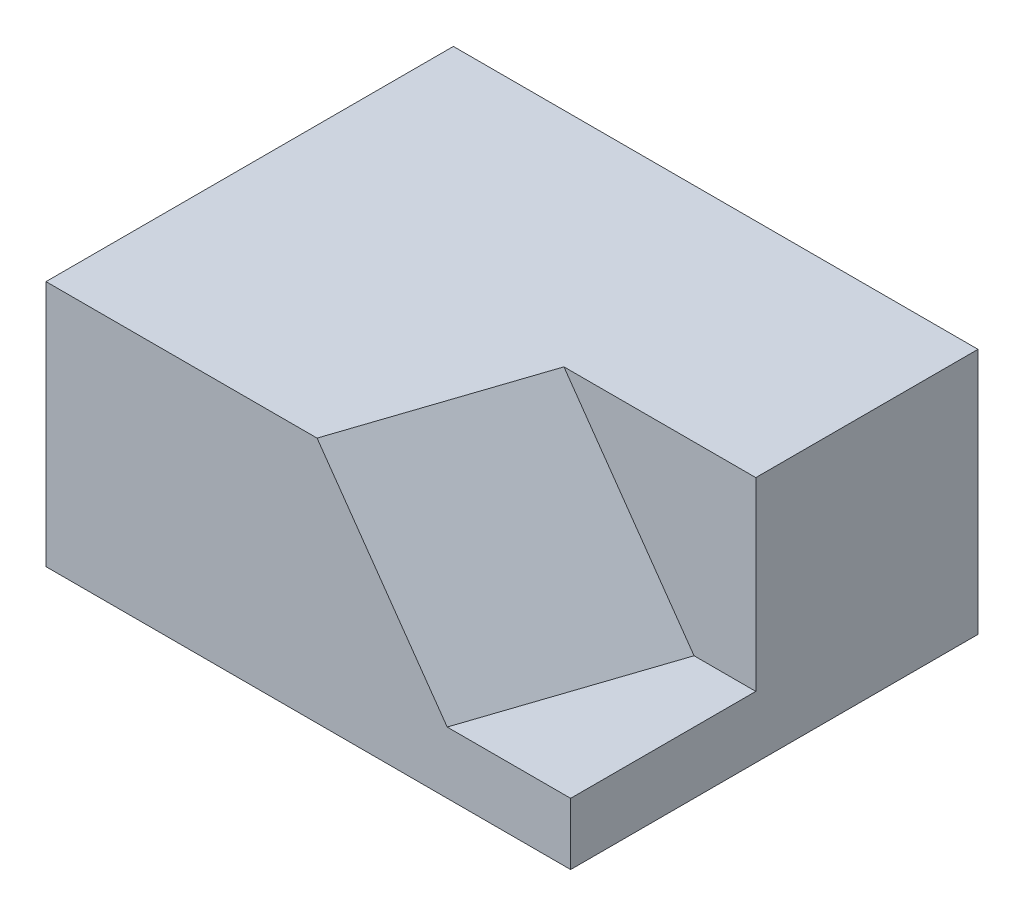
ISO-10303-21;
HEADER;
FILE_DESCRIPTION(('STEP AP214'),'2;1');
FILE_NAME('part.step','',(''),(''),'','','');
FILE_SCHEMA(('AUTOMOTIVE_DESIGN { 1 0 10303 214 1 1 1 1 }'));
ENDSEC;
DATA;
#1=APPLICATION_CONTEXT('core data for automotive mechanical design processes');
#2=APPLICATION_PROTOCOL_DEFINITION('international standard','automotive_design',2000,#1);
#3=PRODUCT_CONTEXT('',#1,'mechanical');
#4=PRODUCT('Part','Part','',(#3));
#5=PRODUCT_RELATED_PRODUCT_CATEGORY('part','',(#4));
#6=PRODUCT_DEFINITION_FORMATION('','',#4);
#7=PRODUCT_DEFINITION_CONTEXT('part definition',#1,'design');
#8=PRODUCT_DEFINITION('design','',#6,#7);
#9=PRODUCT_DEFINITION_SHAPE('','',#8);
#10=(LENGTH_UNIT() NAMED_UNIT(*) SI_UNIT(.MILLI.,.METRE.));
#11=(NAMED_UNIT(*) PLANE_ANGLE_UNIT() SI_UNIT($,.RADIAN.));
#12=(NAMED_UNIT(*) SI_UNIT($,.STERADIAN.) SOLID_ANGLE_UNIT());
#13=UNCERTAINTY_MEASURE_WITH_UNIT(LENGTH_MEASURE(1.E-05),#10,'distance_accuracy_value','');
#14=(GEOMETRIC_REPRESENTATION_CONTEXT(3) GLOBAL_UNCERTAINTY_ASSIGNED_CONTEXT((#13)) GLOBAL_UNIT_ASSIGNED_CONTEXT((#10,
#11,#12)) REPRESENTATION_CONTEXT('',''));
#15=CARTESIAN_POINT('',(0.,0.,0.));
#16=DIRECTION('',(0.,0.,1.));
#17=DIRECTION('',(1.,0.,0.));
#18=AXIS2_PLACEMENT_3D('',#15,#16,#17);
#19=CARTESIAN_POINT('',(0.,40.,0.));
#20=DIRECTION('',(0.,0.,-1.));
#21=DIRECTION('',(-1.,0.,0.));
#22=AXIS2_PLACEMENT_3D('',#19,#20,#21);
#23=PLANE('',#22);
#24=DIRECTION('',(1.,0.,0.));
#25=VECTOR('',#24,1.);
#26=CARTESIAN_POINT('',(0.,10.,0.));
#27=LINE('',#26,#25);
#28=CARTESIAN_POINT('',(65.,10.,0.));
#29=VERTEX_POINT('',#28);
#30=CARTESIAN_POINT('',(85.,10.,0.));
#31=VERTEX_POINT('',#30);
#32=EDGE_CURVE('E113',#29,#31,#27,.T.);
#33=ORIENTED_EDGE('',*,*,#32,.F.);
#34=DIRECTION('',(-0.574959574576068,0.818181818181819,0.));
#35=VECTOR('',#34,1.);
#36=CARTESIAN_POINT('',(42.4663092980881,42.0660040185099,0.));
#37=LINE('',#36,#35);
#38=CARTESIAN_POINT('',(43.9181489322108,40.,0.));
#39=VERTEX_POINT('',#38);
#40=EDGE_CURVE('E45',#29,#39,#37,.T.);
#41=ORIENTED_EDGE('',*,*,#40,.T.);
#42=DIRECTION('',(1.,0.,0.));
#43=VECTOR('',#42,1.);
#44=CARTESIAN_POINT('',(0.,40.,0.));
#45=LINE('',#44,#43);
#46=CARTESIAN_POINT('',(0.,40.,0.));
#47=VERTEX_POINT('',#46);
#48=EDGE_CURVE('E119',#47,#39,#45,.T.);
#49=ORIENTED_EDGE('',*,*,#48,.F.);
#50=DIRECTION('',(0.,-1.,0.));
#51=VECTOR('',#50,1.);
#52=CARTESIAN_POINT('',(0.,40.,0.));
#53=LINE('',#52,#51);
#54=CARTESIAN_POINT('',(0.,0.,0.));
#55=VERTEX_POINT('',#54);
#56=EDGE_CURVE('E142',#47,#55,#53,.T.);
#57=ORIENTED_EDGE('',*,*,#56,.T.);
#58=DIRECTION('',(1.,0.,0.));
#59=VECTOR('',#58,1.);
#60=CARTESIAN_POINT('',(0.,0.,0.));
#61=LINE('',#60,#59);
#62=CARTESIAN_POINT('',(85.,0.,0.));
#63=VERTEX_POINT('',#62);
#64=EDGE_CURVE('E129',#55,#63,#61,.T.);
#65=ORIENTED_EDGE('',*,*,#64,.T.);
#66=DIRECTION('',(0.,-1.,0.));
#67=VECTOR('',#66,1.);
#68=CARTESIAN_POINT('',(85.,40.,0.));
#69=LINE('',#68,#67);
#70=EDGE_CURVE('E140',#31,#63,#69,.T.);
#71=ORIENTED_EDGE('',*,*,#70,.F.);
#72=EDGE_LOOP('',(#33,#41,#49,#57,#65,#71));
#73=FACE_BOUND('',#72,.T.);
#74=ADVANCED_FACE('F37',(#73),#23,.F.);
#75=CARTESIAN_POINT('',(85.,40.,0.));
#76=DIRECTION('',(-1.,0.,0.));
#77=DIRECTION('',(0.,0.,1.));
#78=AXIS2_PLACEMENT_3D('',#75,#76,#77);
#79=PLANE('',#78);
#80=DIRECTION('',(0.,-1.,0.));
#81=VECTOR('',#80,1.);
#82=CARTESIAN_POINT('',(85.,233.510670334996,-30.));
#83=LINE('',#82,#81);
#84=CARTESIAN_POINT('',(85.,40.,-30.));
#85=VERTEX_POINT('',#84);
#86=CARTESIAN_POINT('',(85.,10.,-30.));
#87=VERTEX_POINT('',#86);
#88=EDGE_CURVE('E107',#85,#87,#83,.T.);
#89=ORIENTED_EDGE('',*,*,#88,.T.);
#90=DIRECTION('',(0.,0.,-1.));
#91=VECTOR('',#90,1.);
#92=CARTESIAN_POINT('',(85.,10.,0.));
#93=LINE('',#92,#91);
#94=EDGE_CURVE('E105',#31,#87,#93,.T.);
#95=ORIENTED_EDGE('',*,*,#94,.F.);
#96=ORIENTED_EDGE('',*,*,#70,.T.);
#97=DIRECTION('',(0.,0.,-1.));
#98=VECTOR('',#97,1.);
#99=CARTESIAN_POINT('',(85.,0.,0.));
#100=LINE('',#99,#98);
#101=CARTESIAN_POINT('',(85.,0.,-66.));
#102=VERTEX_POINT('',#101);
#103=EDGE_CURVE('E132',#63,#102,#100,.T.);
#104=ORIENTED_EDGE('',*,*,#103,.T.);
#105=DIRECTION('',(0.,-1.,0.));
#106=VECTOR('',#105,1.);
#107=CARTESIAN_POINT('',(85.,40.,-66.));
#108=LINE('',#107,#106);
#109=CARTESIAN_POINT('',(85.,40.,-66.));
#110=VERTEX_POINT('',#109);
#111=EDGE_CURVE('E137',#110,#102,#108,.T.);
#112=ORIENTED_EDGE('',*,*,#111,.F.);
#113=DIRECTION('',(0.,0.,-1.));
#114=VECTOR('',#113,1.);
#115=CARTESIAN_POINT('',(85.,40.,0.));
#116=LINE('',#115,#114);
#117=EDGE_CURVE('E122',#85,#110,#116,.T.);
#118=ORIENTED_EDGE('',*,*,#117,.F.);
#119=EDGE_LOOP('',(#89,#95,#96,#104,#112,#118));
#120=FACE_BOUND('',#119,.T.);
#121=ADVANCED_FACE('F162',(#120),#79,.F.);
#122=CARTESIAN_POINT('',(0.,40.,0.));
#123=DIRECTION('',(0.,-1.,0.));
#124=DIRECTION('',(0.,0.,-1.));
#125=AXIS2_PLACEMENT_3D('',#122,#123,#124);
#126=PLANE('',#125);
#127=ORIENTED_EDGE('',*,*,#48,.T.);
#128=DIRECTION('',(0.316227766016838,0.,-0.948683298050514));
#129=VECTOR('',#128,1.);
#130=CARTESIAN_POINT('',(56.0263340389897,40.,-36.3245553203368));
#131=LINE('',#130,#129);
#132=CARTESIAN_POINT('',(53.9181489322108,40.,-30.));
#133=VERTEX_POINT('',#132);
#134=EDGE_CURVE('E145',#39,#133,#131,.T.);
#135=ORIENTED_EDGE('',*,*,#134,.T.);
#136=DIRECTION('',(1.,0.,0.));
#137=VECTOR('',#136,1.);
#138=CARTESIAN_POINT('',(85.,40.,-30.));
#139=LINE('',#138,#137);
#140=EDGE_CURVE('E51',#133,#85,#139,.T.);
#141=ORIENTED_EDGE('',*,*,#140,.T.);
#142=ORIENTED_EDGE('',*,*,#117,.T.);
#143=DIRECTION('',(-1.,0.,0.));
#144=VECTOR('',#143,1.);
#145=CARTESIAN_POINT('',(0.,40.,-66.));
#146=LINE('',#145,#144);
#147=CARTESIAN_POINT('',(0.,40.,-66.));
#148=VERTEX_POINT('',#147);
#149=EDGE_CURVE('E124',#110,#148,#146,.T.);
#150=ORIENTED_EDGE('',*,*,#149,.T.);
#151=DIRECTION('',(0.,0.,1.));
#152=VECTOR('',#151,1.);
#153=CARTESIAN_POINT('',(0.,40.,0.));
#154=LINE('',#153,#152);
#155=EDGE_CURVE('E116',#148,#47,#154,.T.);
#156=ORIENTED_EDGE('',*,*,#155,.T.);
#157=EDGE_LOOP('',(#127,#135,#141,#142,#150,#156));
#158=FACE_BOUND('',#157,.T.);
#159=ADVANCED_FACE('F147',(#158),#126,.F.);
#160=CARTESIAN_POINT('',(0.,40.,0.));
#161=DIRECTION('',(1.,0.,0.));
#162=DIRECTION('',(0.,0.,-1.));
#163=AXIS2_PLACEMENT_3D('',#160,#161,#162);
#164=PLANE('',#163);
#165=DIRECTION('',(0.,0.,1.));
#166=VECTOR('',#165,1.);
#167=CARTESIAN_POINT('',(0.,0.,0.));
#168=LINE('',#167,#166);
#169=CARTESIAN_POINT('',(0.,0.,-66.));
#170=VERTEX_POINT('',#169);
#171=EDGE_CURVE('E109',#170,#55,#168,.T.);
#172=ORIENTED_EDGE('',*,*,#171,.T.);
#173=ORIENTED_EDGE('',*,*,#56,.F.);
#174=ORIENTED_EDGE('',*,*,#155,.F.);
#175=DIRECTION('',(0.,-1.,0.));
#176=VECTOR('',#175,1.);
#177=CARTESIAN_POINT('',(0.,40.,-66.));
#178=LINE('',#177,#176);
#179=EDGE_CURVE('E126',#148,#170,#178,.T.);
#180=ORIENTED_EDGE('',*,*,#179,.T.);
#181=EDGE_LOOP('',(#172,#173,#174,#180));
#182=FACE_BOUND('',#181,.T.);
#183=ADVANCED_FACE('F155',(#182),#164,.F.);
#184=CARTESIAN_POINT('',(0.,40.,-66.));
#185=DIRECTION('',(0.,0.,1.));
#186=DIRECTION('',(1.,0.,0.));
#187=AXIS2_PLACEMENT_3D('',#184,#185,#186);
#188=PLANE('',#187);
#189=DIRECTION('',(-1.,0.,0.));
#190=VECTOR('',#189,1.);
#191=CARTESIAN_POINT('',(0.,0.,-66.));
#192=LINE('',#191,#190);
#193=EDGE_CURVE('E120',#102,#170,#192,.T.);
#194=ORIENTED_EDGE('',*,*,#193,.T.);
#195=ORIENTED_EDGE('',*,*,#179,.F.);
#196=ORIENTED_EDGE('',*,*,#149,.F.);
#197=ORIENTED_EDGE('',*,*,#111,.T.);
#198=EDGE_LOOP('',(#194,#195,#196,#197));
#199=FACE_BOUND('',#198,.T.);
#200=ADVANCED_FACE('F165',(#199),#188,.F.);
#201=CARTESIAN_POINT('',(0.,0.,0.));
#202=DIRECTION('',(0.,-1.,0.));
#203=DIRECTION('',(0.,0.,-1.));
#204=AXIS2_PLACEMENT_3D('',#201,#202,#203);
#205=PLANE('',#204);
#206=ORIENTED_EDGE('',*,*,#171,.F.);
#207=ORIENTED_EDGE('',*,*,#193,.F.);
#208=ORIENTED_EDGE('',*,*,#103,.F.);
#209=ORIENTED_EDGE('',*,*,#64,.F.);
#210=EDGE_LOOP('',(#206,#207,#208,#209));
#211=FACE_BOUND('',#210,.T.);
#212=ADVANCED_FACE('F159',(#211),#205,.T.);
#213=CARTESIAN_POINT('',(85.,233.510670334996,-30.));
#214=DIRECTION('',(0.,0.,1.));
#215=DIRECTION('',(1.,0.,0.));
#216=AXIS2_PLACEMENT_3D('',#213,#214,#215);
#217=PLANE('',#216);
#218=ORIENTED_EDGE('',*,*,#140,.F.);
#219=DIRECTION('',(0.574959574576068,-0.818181818181819,0.));
#220=VECTOR('',#219,1.);
#221=CARTESIAN_POINT('',(49.1605241741212,46.7702187195869,-30.));
#222=LINE('',#221,#220);
#223=CARTESIAN_POINT('',(75.,10.,-30.));
#224=VERTEX_POINT('',#223);
#225=EDGE_CURVE('E11',#133,#224,#222,.T.);
#226=ORIENTED_EDGE('',*,*,#225,.T.);
#227=DIRECTION('',(1.,0.,0.));
#228=VECTOR('',#227,1.);
#229=CARTESIAN_POINT('',(85.,10.,-30.));
#230=LINE('',#229,#228);
#231=EDGE_CURVE('E94',#224,#87,#230,.T.);
#232=ORIENTED_EDGE('',*,*,#231,.T.);
#233=ORIENTED_EDGE('',*,*,#88,.F.);
#234=EDGE_LOOP('',(#218,#226,#232,#233));
#235=FACE_BOUND('',#234,.T.);
#236=ADVANCED_FACE('F93',(#235),#217,.T.);
#237=CARTESIAN_POINT('',(0.,10.,0.));
#238=DIRECTION('',(0.,-1.,0.));
#239=DIRECTION('',(0.,0.,-1.));
#240=AXIS2_PLACEMENT_3D('',#237,#238,#239);
#241=PLANE('',#240);
#242=ORIENTED_EDGE('',*,*,#94,.T.);
#243=ORIENTED_EDGE('',*,*,#231,.F.);
#244=DIRECTION('',(0.316227766016838,0.,-0.948683298050514));
#245=VECTOR('',#244,1.);
#246=CARTESIAN_POINT('',(75.,10.,-30.));
#247=LINE('',#246,#245);
#248=EDGE_CURVE('E104',#29,#224,#247,.T.);
#249=ORIENTED_EDGE('',*,*,#248,.F.);
#250=ORIENTED_EDGE('',*,*,#32,.T.);
#251=EDGE_LOOP('',(#242,#243,#249,#250));
#252=FACE_BOUND('',#251,.T.);
#253=ADVANCED_FACE('F102',(#252),#241,.F.);
#254=CARTESIAN_POINT('',(39.5263340389897,40.,13.1754446796632));
#255=DIRECTION('',(0.789352217376327,0.554700196225228,0.263117405792109));
#256=DIRECTION('',(-0.316227766016838,0.,0.948683298050514));
#257=AXIS2_PLACEMENT_3D('',#254,#255,#256);
#258=PLANE('',#257);
#259=ORIENTED_EDGE('',*,*,#40,.F.);
#260=ORIENTED_EDGE('',*,*,#248,.T.);
#261=ORIENTED_EDGE('',*,*,#225,.F.);
#262=ORIENTED_EDGE('',*,*,#134,.F.);
#263=EDGE_LOOP('',(#259,#260,#261,#262));
#264=FACE_BOUND('',#263,.T.);
#265=ADVANCED_FACE('F39',(#264),#258,.T.);
#266=CLOSED_SHELL('',(#74,#121,#159,#183,#200,#212,#236,#253,#265));
#267=MANIFOLD_SOLID_BREP('B2',#266);
#268=ADVANCED_BREP_SHAPE_REPRESENTATION('',(#18,#267),#14);
#269=SHAPE_DEFINITION_REPRESENTATION(#9,#268);
ENDSEC;
END-ISO-10303-21;
